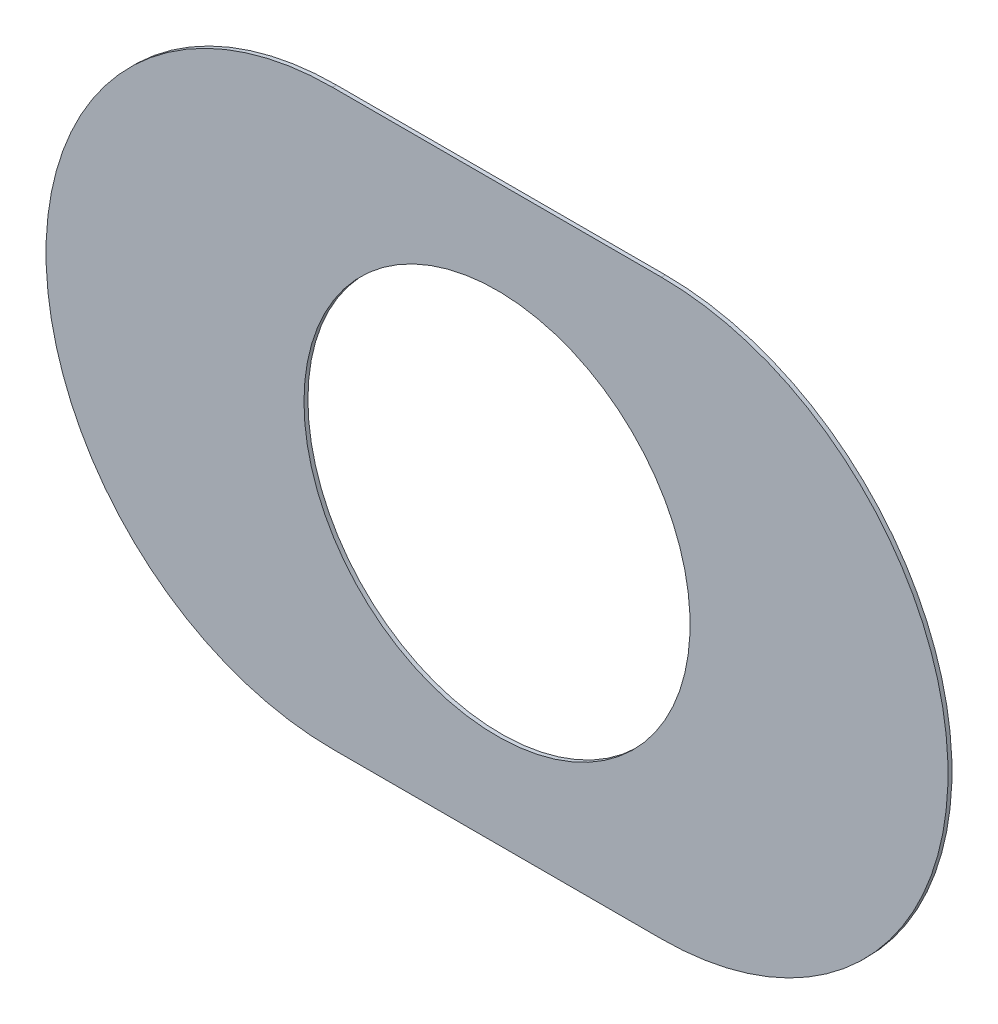
ISO-10303-21;
HEADER;
FILE_DESCRIPTION(('STEP AP214'),'2;1');
FILE_NAME('part.step','',(''),(''),'','','');
FILE_SCHEMA(('AUTOMOTIVE_DESIGN { 1 0 10303 214 1 1 1 1 }'));
ENDSEC;
DATA;
#1=APPLICATION_CONTEXT('core data for automotive mechanical design processes');
#2=APPLICATION_PROTOCOL_DEFINITION('international standard','automotive_design',2000,#1);
#3=PRODUCT_CONTEXT('',#1,'mechanical');
#4=PRODUCT('Part','Part','',(#3));
#5=PRODUCT_RELATED_PRODUCT_CATEGORY('part','',(#4));
#6=PRODUCT_DEFINITION_FORMATION('','',#4);
#7=PRODUCT_DEFINITION_CONTEXT('part definition',#1,'design');
#8=PRODUCT_DEFINITION('design','',#6,#7);
#9=PRODUCT_DEFINITION_SHAPE('','',#8);
#10=(LENGTH_UNIT() NAMED_UNIT(*) SI_UNIT(.MILLI.,.METRE.));
#11=(NAMED_UNIT(*) PLANE_ANGLE_UNIT() SI_UNIT($,.RADIAN.));
#12=(NAMED_UNIT(*) SI_UNIT($,.STERADIAN.) SOLID_ANGLE_UNIT());
#13=UNCERTAINTY_MEASURE_WITH_UNIT(LENGTH_MEASURE(1.E-05),#10,'distance_accuracy_value','');
#14=(GEOMETRIC_REPRESENTATION_CONTEXT(3) GLOBAL_UNCERTAINTY_ASSIGNED_CONTEXT((#13)) GLOBAL_UNIT_ASSIGNED_CONTEXT((#10,
#11,#12)) REPRESENTATION_CONTEXT('',''));
#15=CARTESIAN_POINT('',(0.,0.,0.));
#16=DIRECTION('',(0.,0.,1.));
#17=DIRECTION('',(1.,0.,0.));
#18=AXIS2_PLACEMENT_3D('',#15,#16,#17);
#19=CARTESIAN_POINT('',(1.54999965727325,32.3200006854535,0.));
#20=DIRECTION('',(0.,0.,-1.));
#21=DIRECTION('',(0.,-1.,0.));
#22=AXIS2_PLACEMENT_3D('',#19,#20,#21);
#23=PLANE('',#22);
#24=CARTESIAN_POINT('',(1.54999965727325,32.3200006854535,0.));
#25=DIRECTION('',(0.,0.,1.));
#26=DIRECTION('',(1.,0.,0.));
#27=AXIS2_PLACEMENT_3D('',#24,#25,#26);
#28=CIRCLE('',#27,0.49);
#29=CARTESIAN_POINT('',(1.05999965727325,32.3200006854535,0.));
#30=VERTEX_POINT('',#29);
#31=EDGE_CURVE('E71',#30,#30,#28,.T.);
#32=ORIENTED_EDGE('',*,*,#31,.F.);
#33=EDGE_LOOP('',(#32));
#34=FACE_BOUND('',#33,.T.);
#35=CARTESIAN_POINT('',(1.96740611181985,32.3200006854535,0.));
#36=DIRECTION('',(0.,0.,-1.));
#37=DIRECTION('',(0.,1.,0.));
#38=AXIS2_PLACEMENT_3D('',#35,#36,#37);
#39=CIRCLE('',#38,0.727257121659981);
#40=CARTESIAN_POINT('',(1.96740611181985,33.0472578071135,0.));
#41=VERTEX_POINT('',#40);
#42=CARTESIAN_POINT('',(1.96740611181985,31.5927435637935,0.));
#43=VERTEX_POINT('',#42);
#44=EDGE_CURVE('E27',#41,#43,#39,.T.);
#45=ORIENTED_EDGE('',*,*,#44,.F.);
#46=DIRECTION('',(1.,0.,0.));
#47=VECTOR('',#46,1.);
#48=CARTESIAN_POINT('',(1.13259320272665,33.0472578071135,0.));
#49=LINE('',#48,#47);
#50=CARTESIAN_POINT('',(1.13259320272665,33.0472578071135,0.));
#51=VERTEX_POINT('',#50);
#52=EDGE_CURVE('E103',#51,#41,#49,.T.);
#53=ORIENTED_EDGE('',*,*,#52,.F.);
#54=CARTESIAN_POINT('',(1.13259320272665,32.3200006854535,0.));
#55=DIRECTION('',(0.,0.,-1.));
#56=DIRECTION('',(0.,-1.,0.));
#57=AXIS2_PLACEMENT_3D('',#54,#55,#56);
#58=CIRCLE('',#57,0.727257121659981);
#59=CARTESIAN_POINT('',(1.13259320272665,31.5927435637935,0.));
#60=VERTEX_POINT('',#59);
#61=EDGE_CURVE('E83',#60,#51,#58,.T.);
#62=ORIENTED_EDGE('',*,*,#61,.F.);
#63=DIRECTION('',(-1.,0.,0.));
#64=VECTOR('',#63,1.);
#65=CARTESIAN_POINT('',(1.96740611181985,31.5927435637935,0.));
#66=LINE('',#65,#64);
#67=EDGE_CURVE('E88',#43,#60,#66,.T.);
#68=ORIENTED_EDGE('',*,*,#67,.F.);
#69=EDGE_LOOP('',(#45,#53,#62,#68));
#70=FACE_BOUND('',#69,.T.);
#71=ADVANCED_FACE('F17',(#34,#70),#23,.F.);
#72=CARTESIAN_POINT('',(1.54999965727325,32.3200006854535,-0.01));
#73=DIRECTION('',(0.,0.,-1.));
#74=DIRECTION('',(0.,-1.,0.));
#75=AXIS2_PLACEMENT_3D('',#72,#73,#74);
#76=PLANE('',#75);
#77=CARTESIAN_POINT('',(1.54999965727325,32.3200006854535,-0.01));
#78=DIRECTION('',(0.,0.,1.));
#79=DIRECTION('',(1.,0.,0.));
#80=AXIS2_PLACEMENT_3D('',#77,#78,#79);
#81=CIRCLE('',#80,0.49);
#82=CARTESIAN_POINT('',(1.05999965727325,32.3200006854535,-0.01));
#83=VERTEX_POINT('',#82);
#84=EDGE_CURVE('E69',#83,#83,#81,.T.);
#85=ORIENTED_EDGE('',*,*,#84,.T.);
#86=EDGE_LOOP('',(#85));
#87=FACE_BOUND('',#86,.T.);
#88=CARTESIAN_POINT('',(1.96740611181985,32.3200006854535,-0.01));
#89=DIRECTION('',(0.,0.,-1.));
#90=DIRECTION('',(0.,1.,0.));
#91=AXIS2_PLACEMENT_3D('',#88,#89,#90);
#92=CIRCLE('',#91,0.727257121659981);
#93=CARTESIAN_POINT('',(1.96740611181985,33.0472578071135,-0.01));
#94=VERTEX_POINT('',#93);
#95=CARTESIAN_POINT('',(1.96740611181985,31.5927435637935,-0.01));
#96=VERTEX_POINT('',#95);
#97=EDGE_CURVE('E11',#94,#96,#92,.T.);
#98=ORIENTED_EDGE('',*,*,#97,.T.);
#99=DIRECTION('',(-1.,0.,0.));
#100=VECTOR('',#99,1.);
#101=CARTESIAN_POINT('',(1.96740611181985,31.5927435637935,-0.01));
#102=LINE('',#101,#100);
#103=CARTESIAN_POINT('',(1.13259320272665,31.5927435637935,-0.01));
#104=VERTEX_POINT('',#103);
#105=EDGE_CURVE('E85',#96,#104,#102,.T.);
#106=ORIENTED_EDGE('',*,*,#105,.T.);
#107=CARTESIAN_POINT('',(1.13259320272665,32.3200006854535,-0.01));
#108=DIRECTION('',(0.,0.,-1.));
#109=DIRECTION('',(0.,-1.,0.));
#110=AXIS2_PLACEMENT_3D('',#107,#108,#109);
#111=CIRCLE('',#110,0.727257121659981);
#112=CARTESIAN_POINT('',(1.13259320272665,33.0472578071135,-0.01));
#113=VERTEX_POINT('',#112);
#114=EDGE_CURVE('E93',#104,#113,#111,.T.);
#115=ORIENTED_EDGE('',*,*,#114,.T.);
#116=DIRECTION('',(1.,0.,0.));
#117=VECTOR('',#116,1.);
#118=CARTESIAN_POINT('',(1.13259320272665,33.0472578071135,-0.01));
#119=LINE('',#118,#117);
#120=EDGE_CURVE('E94',#113,#94,#119,.T.);
#121=ORIENTED_EDGE('',*,*,#120,.T.);
#122=EDGE_LOOP('',(#98,#106,#115,#121));
#123=FACE_BOUND('',#122,.T.);
#124=ADVANCED_FACE('F75',(#87,#123),#76,.T.);
#125=CARTESIAN_POINT('',(1.96740611181985,32.3200006854535,0.));
#126=DIRECTION('',(0.,0.,-1.));
#127=DIRECTION('',(0.,1.,0.));
#128=AXIS2_PLACEMENT_3D('',#125,#126,#127);
#129=CYLINDRICAL_SURFACE('',#128,0.727257121659981);
#130=ORIENTED_EDGE('',*,*,#44,.T.);
#131=DIRECTION('',(0.,0.,-1.));
#132=VECTOR('',#131,1.);
#133=CARTESIAN_POINT('',(1.96740611181985,31.5927435637935,0.));
#134=LINE('',#133,#132);
#135=EDGE_CURVE('E87',#43,#96,#134,.T.);
#136=ORIENTED_EDGE('',*,*,#135,.T.);
#137=ORIENTED_EDGE('',*,*,#97,.F.);
#138=DIRECTION('',(0.,0.,-1.));
#139=VECTOR('',#138,1.);
#140=CARTESIAN_POINT('',(1.96740611181985,33.0472578071135,0.));
#141=LINE('',#140,#139);
#142=EDGE_CURVE('E98',#41,#94,#141,.T.);
#143=ORIENTED_EDGE('',*,*,#142,.F.);
#144=EDGE_LOOP('',(#130,#136,#137,#143));
#145=FACE_BOUND('',#144,.T.);
#146=ADVANCED_FACE('F138',(#145),#129,.T.);
#147=CARTESIAN_POINT('',(1.96740611181985,31.5927435637935,0.));
#148=DIRECTION('',(0.,-1.,0.));
#149=DIRECTION('',(0.,0.,-1.));
#150=AXIS2_PLACEMENT_3D('',#147,#148,#149);
#151=PLANE('',#150);
#152=ORIENTED_EDGE('',*,*,#67,.T.);
#153=DIRECTION('',(0.,0.,-1.));
#154=VECTOR('',#153,1.);
#155=CARTESIAN_POINT('',(1.13259320272665,31.5927435637935,0.));
#156=LINE('',#155,#154);
#157=EDGE_CURVE('E89',#60,#104,#156,.T.);
#158=ORIENTED_EDGE('',*,*,#157,.T.);
#159=ORIENTED_EDGE('',*,*,#105,.F.);
#160=ORIENTED_EDGE('',*,*,#135,.F.);
#161=EDGE_LOOP('',(#152,#158,#159,#160));
#162=FACE_BOUND('',#161,.T.);
#163=ADVANCED_FACE('F187',(#162),#151,.T.);
#164=CARTESIAN_POINT('',(1.13259320272665,32.3200006854535,0.));
#165=DIRECTION('',(0.,0.,-1.));
#166=DIRECTION('',(0.,-1.,0.));
#167=AXIS2_PLACEMENT_3D('',#164,#165,#166);
#168=CYLINDRICAL_SURFACE('',#167,0.727257121659981);
#169=ORIENTED_EDGE('',*,*,#61,.T.);
#170=DIRECTION('',(0.,0.,-1.));
#171=VECTOR('',#170,1.);
#172=CARTESIAN_POINT('',(1.13259320272665,33.0472578071135,0.));
#173=LINE('',#172,#171);
#174=EDGE_CURVE('E97',#51,#113,#173,.T.);
#175=ORIENTED_EDGE('',*,*,#174,.T.);
#176=ORIENTED_EDGE('',*,*,#114,.F.);
#177=ORIENTED_EDGE('',*,*,#157,.F.);
#178=EDGE_LOOP('',(#169,#175,#176,#177));
#179=FACE_BOUND('',#178,.T.);
#180=ADVANCED_FACE('F129',(#179),#168,.T.);
#181=CARTESIAN_POINT('',(1.13259320272665,33.0472578071135,0.));
#182=DIRECTION('',(0.,1.,0.));
#183=DIRECTION('',(1.,0.,0.));
#184=AXIS2_PLACEMENT_3D('',#181,#182,#183);
#185=PLANE('',#184);
#186=ORIENTED_EDGE('',*,*,#52,.T.);
#187=ORIENTED_EDGE('',*,*,#142,.T.);
#188=ORIENTED_EDGE('',*,*,#120,.F.);
#189=ORIENTED_EDGE('',*,*,#174,.F.);
#190=EDGE_LOOP('',(#186,#187,#188,#189));
#191=FACE_BOUND('',#190,.T.);
#192=ADVANCED_FACE('F134',(#191),#185,.T.);
#193=CARTESIAN_POINT('',(1.54999965727325,32.3200006854535,0.));
#194=DIRECTION('',(0.,0.,-1.));
#195=DIRECTION('',(1.,0.,0.));
#196=AXIS2_PLACEMENT_3D('',#193,#194,#195);
#197=CYLINDRICAL_SURFACE('',#196,0.49);
#198=ORIENTED_EDGE('',*,*,#84,.F.);
#199=DIRECTION('',(0.,0.,1.));
#200=VECTOR('',#199,1.);
#201=CARTESIAN_POINT('',(1.05999965727325,32.3200006854535,0.));
#202=LINE('',#201,#200);
#203=EDGE_CURVE('E67',#83,#30,#202,.T.);
#204=ORIENTED_EDGE('',*,*,#203,.T.);
#205=ORIENTED_EDGE('',*,*,#31,.T.);
#206=ORIENTED_EDGE('',*,*,#203,.F.);
#207=EDGE_LOOP('',(#198,#204,#205,#206));
#208=FACE_BOUND('',#207,.T.);
#209=ADVANCED_FACE('F19',(#208),#197,.F.);
#210=CLOSED_SHELL('',(#71,#124,#146,#163,#180,#192,#209));
#211=MANIFOLD_SOLID_BREP('B1',#210);
#212=ADVANCED_BREP_SHAPE_REPRESENTATION('',(#18,#211),#14);
#213=SHAPE_DEFINITION_REPRESENTATION(#9,#212);
ENDSEC;
END-ISO-10303-21;
